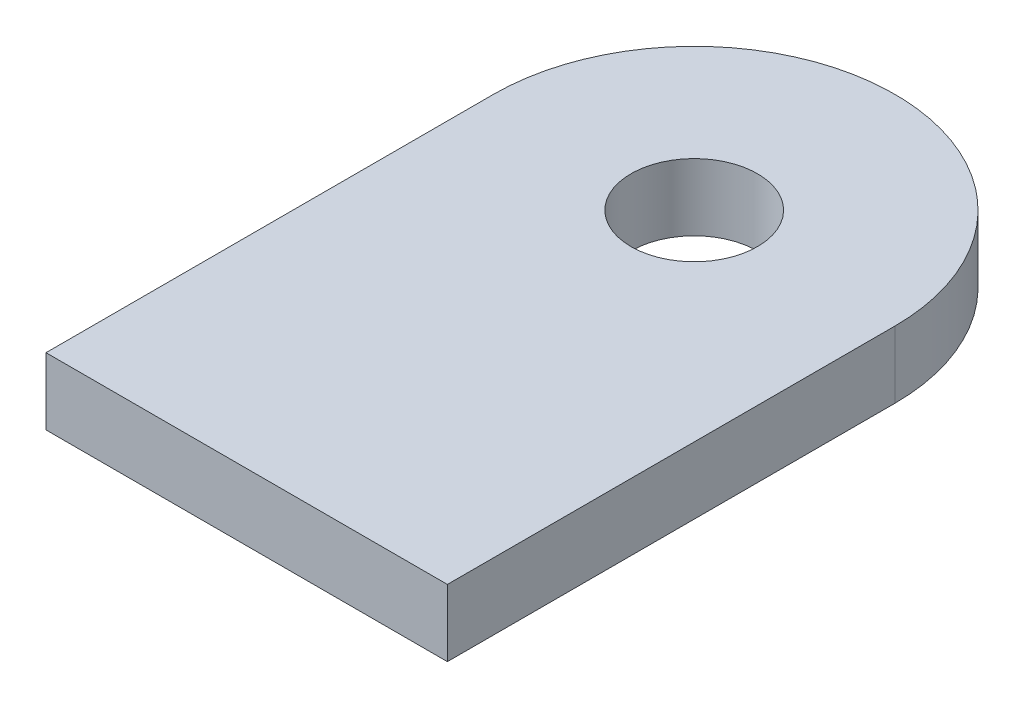
ISO-10303-21;
HEADER;
FILE_DESCRIPTION(('STEP AP214'),'2;1');
FILE_NAME('part.step','',(''),(''),'','','');
FILE_SCHEMA(('AUTOMOTIVE_DESIGN { 1 0 10303 214 1 1 1 1 }'));
ENDSEC;
DATA;
#1=APPLICATION_CONTEXT('core data for automotive mechanical design processes');
#2=APPLICATION_PROTOCOL_DEFINITION('international standard','automotive_design',2000,#1);
#3=PRODUCT_CONTEXT('',#1,'mechanical');
#4=PRODUCT('Part','Part','',(#3));
#5=PRODUCT_RELATED_PRODUCT_CATEGORY('part','',(#4));
#6=PRODUCT_DEFINITION_FORMATION('','',#4);
#7=PRODUCT_DEFINITION_CONTEXT('part definition',#1,'design');
#8=PRODUCT_DEFINITION('design','',#6,#7);
#9=PRODUCT_DEFINITION_SHAPE('','',#8);
#10=(LENGTH_UNIT() NAMED_UNIT(*) SI_UNIT(.MILLI.,.METRE.));
#11=(NAMED_UNIT(*) PLANE_ANGLE_UNIT() SI_UNIT($,.RADIAN.));
#12=(NAMED_UNIT(*) SI_UNIT($,.STERADIAN.) SOLID_ANGLE_UNIT());
#13=UNCERTAINTY_MEASURE_WITH_UNIT(LENGTH_MEASURE(1.E-05),#10,'distance_accuracy_value','');
#14=(GEOMETRIC_REPRESENTATION_CONTEXT(3) GLOBAL_UNCERTAINTY_ASSIGNED_CONTEXT((#13)) GLOBAL_UNIT_ASSIGNED_CONTEXT((#10,
#11,#12)) REPRESENTATION_CONTEXT('',''));
#15=CARTESIAN_POINT('',(0.,0.,0.));
#16=DIRECTION('',(0.,0.,1.));
#17=DIRECTION('',(1.,0.,0.));
#18=AXIS2_PLACEMENT_3D('',#15,#16,#17);
#19=CARTESIAN_POINT('',(0.,3.175,0.));
#20=DIRECTION('',(0.,-1.,0.));
#21=DIRECTION('',(0.,0.,-1.));
#22=AXIS2_PLACEMENT_3D('',#19,#20,#21);
#23=PLANE('',#22);
#24=DIRECTION('',(1.,0.,0.));
#25=VECTOR('',#24,1.);
#26=CARTESIAN_POINT('',(-9.525,3.175,21.24));
#27=LINE('',#26,#25);
#28=CARTESIAN_POINT('',(-9.525,3.175,21.24));
#29=VERTEX_POINT('',#28);
#30=CARTESIAN_POINT('',(9.525,3.175,21.24));
#31=VERTEX_POINT('',#30);
#32=EDGE_CURVE('E89',#29,#31,#27,.T.);
#33=ORIENTED_EDGE('',*,*,#32,.T.);
#34=DIRECTION('',(0.,0.,-1.));
#35=VECTOR('',#34,1.);
#36=CARTESIAN_POINT('',(9.525,3.175,0.));
#37=LINE('',#36,#35);
#38=CARTESIAN_POINT('',(9.525,3.175,0.));
#39=VERTEX_POINT('',#38);
#40=EDGE_CURVE('E84',#31,#39,#37,.T.);
#41=ORIENTED_EDGE('',*,*,#40,.T.);
#42=CARTESIAN_POINT('',(0.,3.175,0.));
#43=DIRECTION('',(0.,1.,0.));
#44=DIRECTION('',(0.,0.,-1.));
#45=AXIS2_PLACEMENT_3D('',#42,#43,#44);
#46=CIRCLE('',#45,9.525);
#47=CARTESIAN_POINT('',(-9.525,3.175,0.));
#48=VERTEX_POINT('',#47);
#49=EDGE_CURVE('E87',#39,#48,#46,.T.);
#50=ORIENTED_EDGE('',*,*,#49,.T.);
#51=DIRECTION('',(0.,0.,1.));
#52=VECTOR('',#51,1.);
#53=CARTESIAN_POINT('',(-9.525,3.175,0.));
#54=LINE('',#53,#52);
#55=EDGE_CURVE('E54',#48,#29,#54,.T.);
#56=ORIENTED_EDGE('',*,*,#55,.T.);
#57=EDGE_LOOP('',(#33,#41,#50,#56));
#58=FACE_BOUND('',#57,.T.);
#59=CARTESIAN_POINT('',(0.,3.175,0.));
#60=DIRECTION('',(0.,1.,0.));
#61=DIRECTION('',(0.,0.,1.));
#62=AXIS2_PLACEMENT_3D('',#59,#60,#61);
#63=CIRCLE('',#62,3.);
#64=CARTESIAN_POINT('',(0.,3.175,3.));
#65=VERTEX_POINT('',#64);
#66=EDGE_CURVE('E104',#65,#65,#63,.T.);
#67=ORIENTED_EDGE('',*,*,#66,.F.);
#68=EDGE_LOOP('',(#67));
#69=FACE_BOUND('',#68,.T.);
#70=ADVANCED_FACE('F37',(#58,#69),#23,.F.);
#71=CARTESIAN_POINT('',(0.,0.,0.));
#72=DIRECTION('',(0.,-1.,0.));
#73=DIRECTION('',(0.,0.,-1.));
#74=AXIS2_PLACEMENT_3D('',#71,#72,#73);
#75=PLANE('',#74);
#76=DIRECTION('',(1.,0.,0.));
#77=VECTOR('',#76,1.);
#78=CARTESIAN_POINT('',(-9.525,0.,21.24));
#79=LINE('',#78,#77);
#80=CARTESIAN_POINT('',(-9.525,0.,21.24));
#81=VERTEX_POINT('',#80);
#82=CARTESIAN_POINT('',(9.525,0.,21.24));
#83=VERTEX_POINT('',#82);
#84=EDGE_CURVE('E101',#81,#83,#79,.T.);
#85=ORIENTED_EDGE('',*,*,#84,.F.);
#86=DIRECTION('',(0.,0.,1.));
#87=VECTOR('',#86,1.);
#88=CARTESIAN_POINT('',(-9.525,0.,0.));
#89=LINE('',#88,#87);
#90=CARTESIAN_POINT('',(-9.525,0.,0.));
#91=VERTEX_POINT('',#90);
#92=EDGE_CURVE('E77',#91,#81,#89,.T.);
#93=ORIENTED_EDGE('',*,*,#92,.F.);
#94=CARTESIAN_POINT('',(0.,0.,0.));
#95=DIRECTION('',(0.,1.,0.));
#96=DIRECTION('',(0.,0.,-1.));
#97=AXIS2_PLACEMENT_3D('',#94,#95,#96);
#98=CIRCLE('',#97,9.525);
#99=CARTESIAN_POINT('',(9.525,0.,0.));
#100=VERTEX_POINT('',#99);
#101=EDGE_CURVE('E71',#100,#91,#98,.T.);
#102=ORIENTED_EDGE('',*,*,#101,.F.);
#103=DIRECTION('',(0.,0.,-1.));
#104=VECTOR('',#103,1.);
#105=CARTESIAN_POINT('',(9.525,0.,0.));
#106=LINE('',#105,#104);
#107=EDGE_CURVE('E93',#83,#100,#106,.T.);
#108=ORIENTED_EDGE('',*,*,#107,.F.);
#109=EDGE_LOOP('',(#85,#93,#102,#108));
#110=FACE_BOUND('',#109,.T.);
#111=CARTESIAN_POINT('',(0.,0.,0.));
#112=DIRECTION('',(0.,1.,0.));
#113=DIRECTION('',(0.,0.,1.));
#114=AXIS2_PLACEMENT_3D('',#111,#112,#113);
#115=CIRCLE('',#114,3.);
#116=CARTESIAN_POINT('',(0.,0.,3.));
#117=VERTEX_POINT('',#116);
#118=EDGE_CURVE('E116',#117,#117,#115,.T.);
#119=ORIENTED_EDGE('',*,*,#118,.T.);
#120=EDGE_LOOP('',(#119));
#121=FACE_BOUND('',#120,.T.);
#122=ADVANCED_FACE('F112',(#110,#121),#75,.T.);
#123=CARTESIAN_POINT('',(-9.525,3.175,21.24));
#124=DIRECTION('',(0.,0.,-1.));
#125=DIRECTION('',(-1.,0.,0.));
#126=AXIS2_PLACEMENT_3D('',#123,#124,#125);
#127=PLANE('',#126);
#128=ORIENTED_EDGE('',*,*,#84,.T.);
#129=DIRECTION('',(0.,-1.,0.));
#130=VECTOR('',#129,1.);
#131=CARTESIAN_POINT('',(9.525,3.175,21.24));
#132=LINE('',#131,#130);
#133=EDGE_CURVE('E11',#31,#83,#132,.T.);
#134=ORIENTED_EDGE('',*,*,#133,.F.);
#135=ORIENTED_EDGE('',*,*,#32,.F.);
#136=DIRECTION('',(0.,-1.,0.));
#137=VECTOR('',#136,1.);
#138=CARTESIAN_POINT('',(-9.525,3.175,21.24));
#139=LINE('',#138,#137);
#140=EDGE_CURVE('E97',#29,#81,#139,.T.);
#141=ORIENTED_EDGE('',*,*,#140,.T.);
#142=EDGE_LOOP('',(#128,#134,#135,#141));
#143=FACE_BOUND('',#142,.T.);
#144=ADVANCED_FACE('F39',(#143),#127,.F.);
#145=CARTESIAN_POINT('',(9.525,3.175,0.));
#146=DIRECTION('',(-1.,0.,0.));
#147=DIRECTION('',(0.,0.,1.));
#148=AXIS2_PLACEMENT_3D('',#145,#146,#147);
#149=PLANE('',#148);
#150=ORIENTED_EDGE('',*,*,#107,.T.);
#151=DIRECTION('',(0.,-1.,0.));
#152=VECTOR('',#151,1.);
#153=CARTESIAN_POINT('',(9.525,3.175,0.));
#154=LINE('',#153,#152);
#155=EDGE_CURVE('E46',#39,#100,#154,.T.);
#156=ORIENTED_EDGE('',*,*,#155,.F.);
#157=ORIENTED_EDGE('',*,*,#40,.F.);
#158=ORIENTED_EDGE('',*,*,#133,.T.);
#159=EDGE_LOOP('',(#150,#156,#157,#158));
#160=FACE_BOUND('',#159,.T.);
#161=ADVANCED_FACE('F92',(#160),#149,.F.);
#162=CARTESIAN_POINT('',(0.,3.175,0.));
#163=DIRECTION('',(0.,-1.,0.));
#164=DIRECTION('',(0.,0.,-1.));
#165=AXIS2_PLACEMENT_3D('',#162,#163,#164);
#166=CYLINDRICAL_SURFACE('',#165,9.525);
#167=ORIENTED_EDGE('',*,*,#101,.T.);
#168=DIRECTION('',(0.,-1.,0.));
#169=VECTOR('',#168,1.);
#170=CARTESIAN_POINT('',(-9.525,3.175,0.));
#171=LINE('',#170,#169);
#172=EDGE_CURVE('E94',#48,#91,#171,.T.);
#173=ORIENTED_EDGE('',*,*,#172,.F.);
#174=ORIENTED_EDGE('',*,*,#49,.F.);
#175=ORIENTED_EDGE('',*,*,#155,.T.);
#176=EDGE_LOOP('',(#167,#173,#174,#175));
#177=FACE_BOUND('',#176,.T.);
#178=ADVANCED_FACE('F95',(#177),#166,.T.);
#179=CARTESIAN_POINT('',(-9.525,3.175,0.));
#180=DIRECTION('',(1.,0.,0.));
#181=DIRECTION('',(0.,0.,-1.));
#182=AXIS2_PLACEMENT_3D('',#179,#180,#181);
#183=PLANE('',#182);
#184=ORIENTED_EDGE('',*,*,#92,.T.);
#185=ORIENTED_EDGE('',*,*,#140,.F.);
#186=ORIENTED_EDGE('',*,*,#55,.F.);
#187=ORIENTED_EDGE('',*,*,#172,.T.);
#188=EDGE_LOOP('',(#184,#185,#186,#187));
#189=FACE_BOUND('',#188,.T.);
#190=ADVANCED_FACE('F109',(#189),#183,.F.);
#191=CARTESIAN_POINT('',(0.,3.175,0.));
#192=DIRECTION('',(0.,-1.,0.));
#193=DIRECTION('',(0.,0.,-1.));
#194=AXIS2_PLACEMENT_3D('',#191,#192,#193);
#195=CYLINDRICAL_SURFACE('',#194,3.);
#196=ORIENTED_EDGE('',*,*,#66,.T.);
#197=EDGE_LOOP('',(#196));
#198=FACE_BOUND('',#197,.T.);
#199=ORIENTED_EDGE('',*,*,#118,.F.);
#200=EDGE_LOOP('',(#199));
#201=FACE_BOUND('',#200,.T.);
#202=ADVANCED_FACE('F122',(#198,#201),#195,.F.);
#203=CLOSED_SHELL('',(#70,#122,#144,#161,#178,#190,#202));
#204=MANIFOLD_SOLID_BREP('B2',#203);
#205=ADVANCED_BREP_SHAPE_REPRESENTATION('',(#18,#204),#14);
#206=SHAPE_DEFINITION_REPRESENTATION(#9,#205);
ENDSEC;
END-ISO-10303-21;
